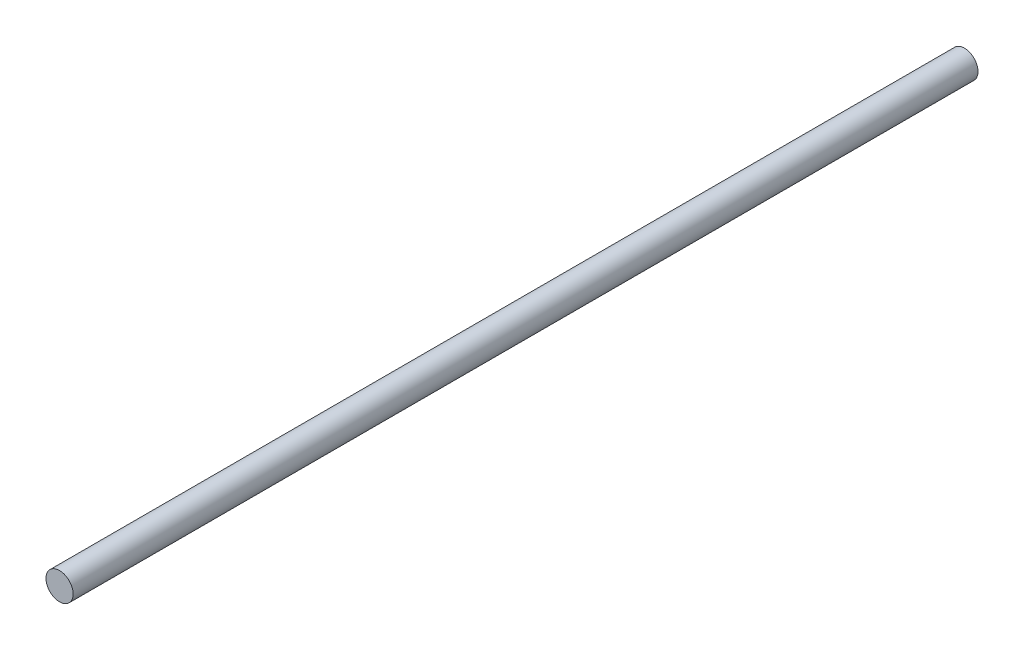
ISO-10303-21;
HEADER;
FILE_DESCRIPTION(('STEP AP214'),'2;1');
FILE_NAME('part.step','',(''),(''),'','','');
FILE_SCHEMA(('AUTOMOTIVE_DESIGN { 1 0 10303 214 1 1 1 1 }'));
ENDSEC;
DATA;
#1=APPLICATION_CONTEXT('core data for automotive mechanical design processes');
#2=APPLICATION_PROTOCOL_DEFINITION('international standard','automotive_design',2000,#1);
#3=PRODUCT_CONTEXT('',#1,'mechanical');
#4=PRODUCT('Part','Part','',(#3));
#5=PRODUCT_RELATED_PRODUCT_CATEGORY('part','',(#4));
#6=PRODUCT_DEFINITION_FORMATION('','',#4);
#7=PRODUCT_DEFINITION_CONTEXT('part definition',#1,'design');
#8=PRODUCT_DEFINITION('design','',#6,#7);
#9=PRODUCT_DEFINITION_SHAPE('','',#8);
#10=(LENGTH_UNIT() NAMED_UNIT(*) SI_UNIT(.MILLI.,.METRE.));
#11=(NAMED_UNIT(*) PLANE_ANGLE_UNIT() SI_UNIT($,.RADIAN.));
#12=(NAMED_UNIT(*) SI_UNIT($,.STERADIAN.) SOLID_ANGLE_UNIT());
#13=UNCERTAINTY_MEASURE_WITH_UNIT(LENGTH_MEASURE(1.E-05),#10,'distance_accuracy_value','');
#14=(GEOMETRIC_REPRESENTATION_CONTEXT(3) GLOBAL_UNCERTAINTY_ASSIGNED_CONTEXT((#13)) GLOBAL_UNIT_ASSIGNED_CONTEXT((#10,
#11,#12)) REPRESENTATION_CONTEXT('',''));
#15=CARTESIAN_POINT('',(0.,0.,0.));
#16=DIRECTION('',(0.,0.,1.));
#17=DIRECTION('',(1.,0.,0.));
#18=AXIS2_PLACEMENT_3D('',#15,#16,#17);
#19=CARTESIAN_POINT('',(0.,0.,200.));
#20=DIRECTION('',(0.,0.,-1.));
#21=DIRECTION('',(-1.,0.,0.));
#22=AXIS2_PLACEMENT_3D('',#19,#20,#21);
#23=CYLINDRICAL_SURFACE('',#22,3.);
#24=CARTESIAN_POINT('',(0.,0.,200.));
#25=DIRECTION('',(0.,0.,1.));
#26=DIRECTION('',(1.,0.,0.));
#27=AXIS2_PLACEMENT_3D('',#24,#25,#26);
#28=CIRCLE('',#27,3.);
#29=CARTESIAN_POINT('',(3.,0.,200.));
#30=VERTEX_POINT('',#29);
#31=EDGE_CURVE('E10',#30,#30,#28,.T.);
#32=ORIENTED_EDGE('',*,*,#31,.F.);
#33=EDGE_LOOP('',(#32));
#34=FACE_BOUND('',#33,.T.);
#35=CARTESIAN_POINT('',(0.,0.,0.));
#36=DIRECTION('',(0.,0.,1.));
#37=DIRECTION('',(1.,0.,0.));
#38=AXIS2_PLACEMENT_3D('',#35,#36,#37);
#39=CIRCLE('',#38,3.);
#40=CARTESIAN_POINT('',(3.,0.,0.));
#41=VERTEX_POINT('',#40);
#42=EDGE_CURVE('E40',#41,#41,#39,.T.);
#43=ORIENTED_EDGE('',*,*,#42,.T.);
#44=EDGE_LOOP('',(#43));
#45=FACE_BOUND('',#44,.T.);
#46=ADVANCED_FACE('F37',(#34,#45),#23,.T.);
#47=CARTESIAN_POINT('',(0.,0.,200.));
#48=DIRECTION('',(0.,0.,1.));
#49=DIRECTION('',(1.,0.,0.));
#50=AXIS2_PLACEMENT_3D('',#47,#48,#49);
#51=PLANE('',#50);
#52=ORIENTED_EDGE('',*,*,#31,.T.);
#53=EDGE_LOOP('',(#52));
#54=FACE_BOUND('',#53,.T.);
#55=ADVANCED_FACE('F52',(#54),#51,.T.);
#56=CARTESIAN_POINT('',(0.,0.,0.));
#57=DIRECTION('',(0.,0.,1.));
#58=DIRECTION('',(1.,0.,0.));
#59=AXIS2_PLACEMENT_3D('',#56,#57,#58);
#60=PLANE('',#59);
#61=ORIENTED_EDGE('',*,*,#42,.F.);
#62=EDGE_LOOP('',(#61));
#63=FACE_BOUND('',#62,.T.);
#64=ADVANCED_FACE('F50',(#63),#60,.F.);
#65=CLOSED_SHELL('',(#46,#55,#64));
#66=MANIFOLD_SOLID_BREP('B2',#65);
#67=ADVANCED_BREP_SHAPE_REPRESENTATION('',(#18,#66),#14);
#68=SHAPE_DEFINITION_REPRESENTATION(#9,#67);
ENDSEC;
END-ISO-10303-21;
